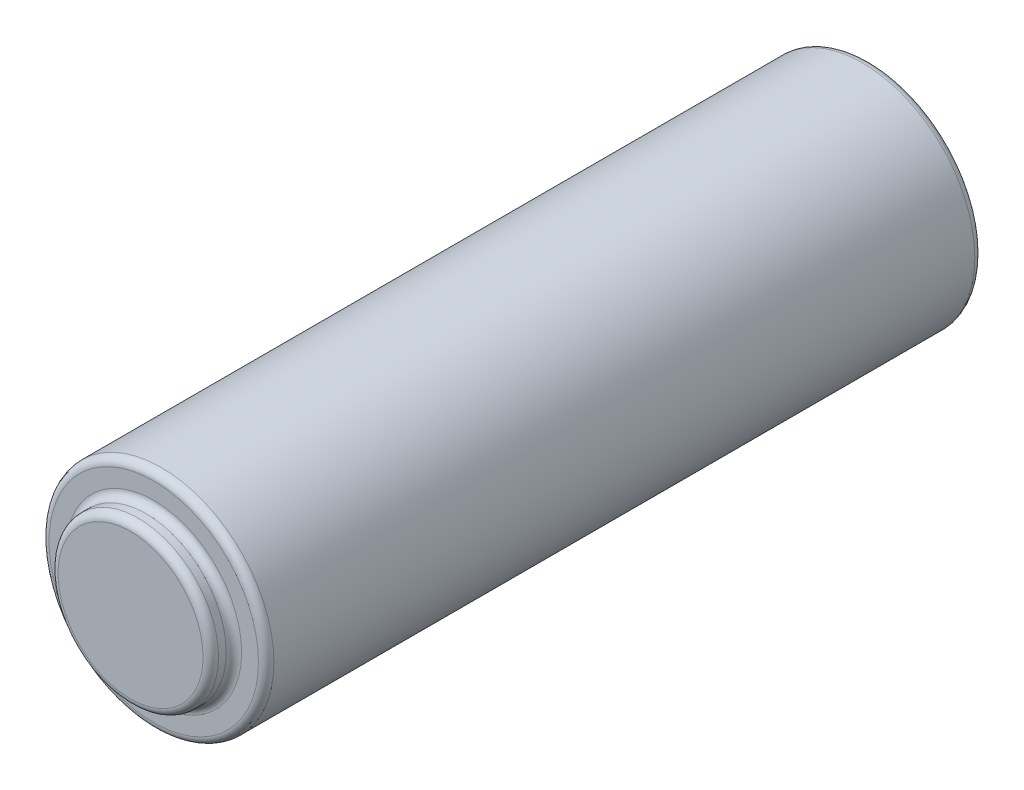
ISO-10303-21;
HEADER;
FILE_DESCRIPTION(('STEP AP214'),'2;1');
FILE_NAME('part.step','',(''),(''),'','','');
FILE_SCHEMA(('AUTOMOTIVE_DESIGN { 1 0 10303 214 1 1 1 1 }'));
ENDSEC;
DATA;
#1=APPLICATION_CONTEXT('core data for automotive mechanical design processes');
#2=APPLICATION_PROTOCOL_DEFINITION('international standard','automotive_design',2000,#1);
#3=PRODUCT_CONTEXT('',#1,'mechanical');
#4=PRODUCT('Part','Part','',(#3));
#5=PRODUCT_RELATED_PRODUCT_CATEGORY('part','',(#4));
#6=PRODUCT_DEFINITION_FORMATION('','',#4);
#7=PRODUCT_DEFINITION_CONTEXT('part definition',#1,'design');
#8=PRODUCT_DEFINITION('design','',#6,#7);
#9=PRODUCT_DEFINITION_SHAPE('','',#8);
#10=(LENGTH_UNIT() NAMED_UNIT(*) SI_UNIT(.MILLI.,.METRE.));
#11=(NAMED_UNIT(*) PLANE_ANGLE_UNIT() SI_UNIT($,.RADIAN.));
#12=(NAMED_UNIT(*) SI_UNIT($,.STERADIAN.) SOLID_ANGLE_UNIT());
#13=UNCERTAINTY_MEASURE_WITH_UNIT(LENGTH_MEASURE(1.E-05),#10,'distance_accuracy_value','');
#14=(GEOMETRIC_REPRESENTATION_CONTEXT(3) GLOBAL_UNCERTAINTY_ASSIGNED_CONTEXT((#13)) GLOBAL_UNIT_ASSIGNED_CONTEXT((#10,
#11,#12)) REPRESENTATION_CONTEXT('',''));
#15=CARTESIAN_POINT('',(0.,0.,0.));
#16=DIRECTION('',(0.,0.,1.));
#17=DIRECTION('',(1.,0.,0.));
#18=AXIS2_PLACEMENT_3D('',#15,#16,#17);
#19=CARTESIAN_POINT('',(23.495,8.89,47.1575010051981));
#20=DIRECTION('',(0.,0.,-1.));
#21=DIRECTION('',(-1.,0.,0.));
#22=AXIS2_PLACEMENT_3D('',#19,#20,#21);
#23=CYLINDRICAL_SURFACE('',#22,7.40044561538614);
#24=CARTESIAN_POINT('',(23.495,8.89,0.508000000000002));
#25=DIRECTION('',(0.,0.,1.));
#26=DIRECTION('',(1.,0.,0.));
#27=AXIS2_PLACEMENT_3D('',#24,#25,#26);
#28=CIRCLE('',#27,7.40044561538614);
#29=CARTESIAN_POINT('',(30.8954456153861,8.89,0.508000000000002));
#30=VERTEX_POINT('',#29);
#31=EDGE_CURVE('E37',#30,#30,#28,.T.);
#32=ORIENTED_EDGE('',*,*,#31,.T.);
#33=EDGE_LOOP('',(#32));
#34=FACE_BOUND('',#33,.T.);
#35=CARTESIAN_POINT('',(23.495,8.89,46.6495010051981));
#36=DIRECTION('',(0.,0.,1.));
#37=DIRECTION('',(1.,0.,0.));
#38=AXIS2_PLACEMENT_3D('',#35,#36,#37);
#39=CIRCLE('',#38,7.40044561538614);
#40=CARTESIAN_POINT('',(30.8954456153861,8.89,46.6495010051981));
#41=VERTEX_POINT('',#40);
#42=EDGE_CURVE('E45',#41,#41,#39,.F.);
#43=ORIENTED_EDGE('',*,*,#42,.T.);
#44=EDGE_LOOP('',(#43));
#45=FACE_BOUND('',#44,.T.);
#46=ADVANCED_FACE('F30',(#34,#45),#23,.T.);
#47=CARTESIAN_POINT('',(23.495,8.89,47.1575010051981));
#48=DIRECTION('',(0.,0.,1.));
#49=DIRECTION('',(1.,0.,0.));
#50=AXIS2_PLACEMENT_3D('',#47,#48,#49);
#51=PLANE('',#50);
#52=CARTESIAN_POINT('',(23.495,8.89,47.1575010051981));
#53=DIRECTION('',(0.,0.,1.));
#54=DIRECTION('',(1.,0.,0.));
#55=AXIS2_PLACEMENT_3D('',#52,#53,#54);
#56=CIRCLE('',#55,6.89244561538614);
#57=CARTESIAN_POINT('',(30.3874456153861,8.89,47.1575010051981));
#58=VERTEX_POINT('',#57);
#59=EDGE_CURVE('E50',#58,#58,#56,.T.);
#60=ORIENTED_EDGE('',*,*,#59,.T.);
#61=EDGE_LOOP('',(#60));
#62=FACE_BOUND('',#61,.T.);
#63=CARTESIAN_POINT('',(23.495,8.89,47.1575010051981));
#64=DIRECTION('',(0.,0.,1.));
#65=DIRECTION('',(1.,0.,0.));
#66=AXIS2_PLACEMENT_3D('',#63,#64,#65);
#67=CIRCLE('',#66,5.78774988366254);
#68=CARTESIAN_POINT('',(29.2827498836625,8.89,47.1575010051981));
#69=VERTEX_POINT('',#68);
#70=EDGE_CURVE('E53',#69,#69,#67,.F.);
#71=ORIENTED_EDGE('',*,*,#70,.T.);
#72=EDGE_LOOP('',(#71));
#73=FACE_BOUND('',#72,.T.);
#74=ADVANCED_FACE('F82',(#62,#73),#51,.T.);
#75=CARTESIAN_POINT('',(23.495,8.89,0.));
#76=DIRECTION('',(0.,0.,1.));
#77=DIRECTION('',(1.,0.,0.));
#78=AXIS2_PLACEMENT_3D('',#75,#76,#77);
#79=PLANE('',#78);
#80=CARTESIAN_POINT('',(23.495,8.89,0.));
#81=DIRECTION('',(0.,0.,1.));
#82=DIRECTION('',(1.,0.,0.));
#83=AXIS2_PLACEMENT_3D('',#80,#81,#82);
#84=CIRCLE('',#83,6.89244561538614);
#85=CARTESIAN_POINT('',(30.3874456153861,8.89,0.));
#86=VERTEX_POINT('',#85);
#87=EDGE_CURVE('E10',#86,#86,#84,.F.);
#88=ORIENTED_EDGE('',*,*,#87,.T.);
#89=EDGE_LOOP('',(#88));
#90=FACE_BOUND('',#89,.T.);
#91=ADVANCED_FACE('F86',(#90),#79,.F.);
#92=CARTESIAN_POINT('',(23.495,8.89,48.6815010051981));
#93=DIRECTION('',(0.,0.,-1.));
#94=DIRECTION('',(-1.,0.,0.));
#95=AXIS2_PLACEMENT_3D('',#92,#93,#94);
#96=CYLINDRICAL_SURFACE('',#95,5.27974988366254);
#97=CARTESIAN_POINT('',(23.495,8.89,47.6655010051981));
#98=DIRECTION('',(0.,0.,1.));
#99=DIRECTION('',(1.,0.,0.));
#100=AXIS2_PLACEMENT_3D('',#97,#98,#99);
#101=CIRCLE('',#100,5.27974988366254);
#102=CARTESIAN_POINT('',(28.7747498836625,8.89,47.6655010051981));
#103=VERTEX_POINT('',#102);
#104=EDGE_CURVE('E41',#103,#103,#101,.T.);
#105=ORIENTED_EDGE('',*,*,#104,.T.);
#106=EDGE_LOOP('',(#105));
#107=FACE_BOUND('',#106,.T.);
#108=CARTESIAN_POINT('',(23.495,8.89,48.1735010051981));
#109=DIRECTION('',(0.,0.,1.));
#110=DIRECTION('',(1.,0.,0.));
#111=AXIS2_PLACEMENT_3D('',#108,#109,#110);
#112=CIRCLE('',#111,5.27974988366254);
#113=CARTESIAN_POINT('',(28.7747498836625,8.89,48.1735010051981));
#114=VERTEX_POINT('',#113);
#115=EDGE_CURVE('E56',#114,#114,#112,.F.);
#116=ORIENTED_EDGE('',*,*,#115,.T.);
#117=EDGE_LOOP('',(#116));
#118=FACE_BOUND('',#117,.T.);
#119=ADVANCED_FACE('F77',(#107,#118),#96,.T.);
#120=CARTESIAN_POINT('',(23.495,8.89,48.6815010051981));
#121=DIRECTION('',(0.,0.,1.));
#122=DIRECTION('',(1.,0.,0.));
#123=AXIS2_PLACEMENT_3D('',#120,#121,#122);
#124=PLANE('',#123);
#125=CARTESIAN_POINT('',(23.495,8.89,48.6815010051981));
#126=DIRECTION('',(0.,0.,1.));
#127=DIRECTION('',(1.,0.,0.));
#128=AXIS2_PLACEMENT_3D('',#125,#126,#127);
#129=CIRCLE('',#128,4.77174988366254);
#130=CARTESIAN_POINT('',(28.2667498836625,8.89,48.6815010051981));
#131=VERTEX_POINT('',#130);
#132=EDGE_CURVE('E59',#131,#131,#129,.T.);
#133=ORIENTED_EDGE('',*,*,#132,.T.);
#134=EDGE_LOOP('',(#133));
#135=FACE_BOUND('',#134,.T.);
#136=ADVANCED_FACE('F63',(#135),#124,.T.);
#137=CARTESIAN_POINT('',(23.495,8.89,48.1735010051981));
#138=DIRECTION('',(0.,0.,1.));
#139=DIRECTION('',(1.,0.,0.));
#140=AXIS2_PLACEMENT_3D('',#137,#138,#139);
#141=TOROIDAL_SURFACE('',#140,4.77174988366254,0.508);
#142=ORIENTED_EDGE('',*,*,#115,.F.);
#143=EDGE_LOOP('',(#142));
#144=FACE_BOUND('',#143,.T.);
#145=ORIENTED_EDGE('',*,*,#132,.F.);
#146=EDGE_LOOP('',(#145));
#147=FACE_BOUND('',#146,.T.);
#148=ADVANCED_FACE('F65',(#144,#147),#141,.T.);
#149=CARTESIAN_POINT('',(23.495,8.89,46.6495010051981));
#150=DIRECTION('',(0.,0.,1.));
#151=DIRECTION('',(1.,0.,0.));
#152=AXIS2_PLACEMENT_3D('',#149,#150,#151);
#153=TOROIDAL_SURFACE('',#152,6.89244561538614,0.508);
#154=ORIENTED_EDGE('',*,*,#42,.F.);
#155=EDGE_LOOP('',(#154));
#156=FACE_BOUND('',#155,.T.);
#157=ORIENTED_EDGE('',*,*,#59,.F.);
#158=EDGE_LOOP('',(#157));
#159=FACE_BOUND('',#158,.T.);
#160=ADVANCED_FACE('F67',(#156,#159),#153,.T.);
#161=CARTESIAN_POINT('',(23.495,8.89,47.6655010051981));
#162=DIRECTION('',(0.,0.,1.));
#163=DIRECTION('',(1.,0.,0.));
#164=AXIS2_PLACEMENT_3D('',#161,#162,#163);
#165=TOROIDAL_SURFACE('',#164,5.78774988366254,0.508);
#166=ORIENTED_EDGE('',*,*,#70,.F.);
#167=EDGE_LOOP('',(#166));
#168=FACE_BOUND('',#167,.T.);
#169=ORIENTED_EDGE('',*,*,#104,.F.);
#170=EDGE_LOOP('',(#169));
#171=FACE_BOUND('',#170,.T.);
#172=ADVANCED_FACE('F74',(#168,#171),#165,.F.);
#173=CARTESIAN_POINT('',(23.495,8.89,0.508000000000002));
#174=DIRECTION('',(0.,0.,1.));
#175=DIRECTION('',(1.,0.,0.));
#176=AXIS2_PLACEMENT_3D('',#173,#174,#175);
#177=TOROIDAL_SURFACE('',#176,6.89244561538614,0.508);
#178=ORIENTED_EDGE('',*,*,#87,.F.);
#179=EDGE_LOOP('',(#178));
#180=FACE_BOUND('',#179,.T.);
#181=ORIENTED_EDGE('',*,*,#31,.F.);
#182=EDGE_LOOP('',(#181));
#183=FACE_BOUND('',#182,.T.);
#184=ADVANCED_FACE('F32',(#180,#183),#177,.T.);
#185=CLOSED_SHELL('',(#46,#74,#91,#119,#136,#148,#160,#172,#184));
#186=MANIFOLD_SOLID_BREP('B2',#185);
#187=ADVANCED_BREP_SHAPE_REPRESENTATION('',(#18,#186),#14);
#188=SHAPE_DEFINITION_REPRESENTATION(#9,#187);
ENDSEC;
END-ISO-10303-21;
